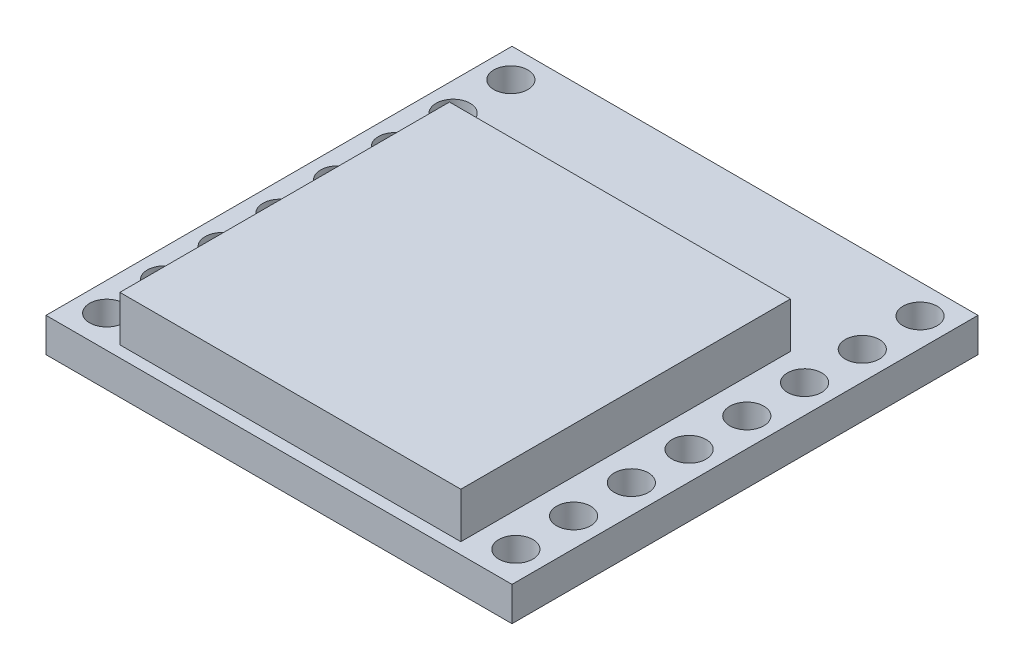
ISO-10303-21;
HEADER;
FILE_DESCRIPTION(('STEP AP214'),'2;1');
FILE_NAME('part.step','',(''),(''),'','','');
FILE_SCHEMA(('AUTOMOTIVE_DESIGN { 1 0 10303 214 1 1 1 1 }'));
ENDSEC;
DATA;
#1=APPLICATION_CONTEXT('core data for automotive mechanical design processes');
#2=APPLICATION_PROTOCOL_DEFINITION('international standard','automotive_design',2000,#1);
#3=PRODUCT_CONTEXT('',#1,'mechanical');
#4=PRODUCT('Part','Part','',(#3));
#5=PRODUCT_RELATED_PRODUCT_CATEGORY('part','',(#4));
#6=PRODUCT_DEFINITION_FORMATION('','',#4);
#7=PRODUCT_DEFINITION_CONTEXT('part definition',#1,'design');
#8=PRODUCT_DEFINITION('design','',#6,#7);
#9=PRODUCT_DEFINITION_SHAPE('','',#8);
#10=(LENGTH_UNIT() NAMED_UNIT(*) SI_UNIT(.MILLI.,.METRE.));
#11=(NAMED_UNIT(*) PLANE_ANGLE_UNIT() SI_UNIT($,.RADIAN.));
#12=(NAMED_UNIT(*) SI_UNIT($,.STERADIAN.) SOLID_ANGLE_UNIT());
#13=UNCERTAINTY_MEASURE_WITH_UNIT(LENGTH_MEASURE(1.E-05),#10,'distance_accuracy_value','');
#14=(GEOMETRIC_REPRESENTATION_CONTEXT(3) GLOBAL_UNCERTAINTY_ASSIGNED_CONTEXT((#13)) GLOBAL_UNIT_ASSIGNED_CONTEXT((#10,
#11,#12)) REPRESENTATION_CONTEXT('',''));
#15=CARTESIAN_POINT('',(0.,0.,0.));
#16=DIRECTION('',(0.,0.,1.));
#17=DIRECTION('',(1.,0.,0.));
#18=AXIS2_PLACEMENT_3D('',#15,#16,#17);
#19=CARTESIAN_POINT('',(0.,1.5,0.));
#20=DIRECTION('',(0.,-1.,0.));
#21=DIRECTION('',(0.,0.,-1.));
#22=AXIS2_PLACEMENT_3D('',#19,#20,#21);
#23=PLANE('',#22);
#24=DIRECTION('',(0.,0.,-1.));
#25=VECTOR('',#24,1.);
#26=CARTESIAN_POINT('',(10.25,1.5,10.25));
#27=LINE('',#26,#25);
#28=CARTESIAN_POINT('',(10.25,1.5,10.25));
#29=VERTEX_POINT('',#28);
#30=CARTESIAN_POINT('',(10.25,1.5,-10.25));
#31=VERTEX_POINT('',#30);
#32=EDGE_CURVE('E220',#29,#31,#27,.T.);
#33=ORIENTED_EDGE('',*,*,#32,.T.);
#34=DIRECTION('',(-1.,0.,0.));
#35=VECTOR('',#34,1.);
#36=CARTESIAN_POINT('',(-10.25,1.5,-10.25));
#37=LINE('',#36,#35);
#38=CARTESIAN_POINT('',(-10.25,1.5,-10.25));
#39=VERTEX_POINT('',#38);
#40=EDGE_CURVE('E223',#31,#39,#37,.T.);
#41=ORIENTED_EDGE('',*,*,#40,.T.);
#42=DIRECTION('',(0.,0.,1.));
#43=VECTOR('',#42,1.);
#44=CARTESIAN_POINT('',(-10.25,1.5,10.25));
#45=LINE('',#44,#43);
#46=CARTESIAN_POINT('',(-10.25,1.5,10.25));
#47=VERTEX_POINT('',#46);
#48=EDGE_CURVE('E226',#39,#47,#45,.T.);
#49=ORIENTED_EDGE('',*,*,#48,.T.);
#50=DIRECTION('',(1.,0.,0.));
#51=VECTOR('',#50,1.);
#52=CARTESIAN_POINT('',(-10.25,1.5,10.25));
#53=LINE('',#52,#51);
#54=EDGE_CURVE('E228',#47,#29,#53,.T.);
#55=ORIENTED_EDGE('',*,*,#54,.T.);
#56=EDGE_LOOP('',(#33,#41,#49,#55));
#57=FACE_BOUND('',#56,.T.);
#58=CARTESIAN_POINT('',(-9.,1.5,-8.95));
#59=DIRECTION('',(0.,-1.,0.));
#60=DIRECTION('',(0.,0.,-1.));
#61=AXIS2_PLACEMENT_3D('',#58,#59,#60);
#62=CIRCLE('',#61,0.75);
#63=CARTESIAN_POINT('',(-9.,1.5,-9.7));
#64=VERTEX_POINT('',#63);
#65=EDGE_CURVE('E130',#64,#64,#62,.T.);
#66=ORIENTED_EDGE('',*,*,#65,.T.);
#67=EDGE_LOOP('',(#66));
#68=FACE_BOUND('',#67,.T.);
#69=CARTESIAN_POINT('',(9.,1.5,-8.95));
#70=DIRECTION('',(0.,-1.,0.));
#71=DIRECTION('',(0.,0.,-1.));
#72=AXIS2_PLACEMENT_3D('',#69,#70,#71);
#73=CIRCLE('',#72,0.75);
#74=CARTESIAN_POINT('',(9.,1.5,-9.7));
#75=VERTEX_POINT('',#74);
#76=EDGE_CURVE('E118',#75,#75,#73,.T.);
#77=ORIENTED_EDGE('',*,*,#76,.T.);
#78=EDGE_LOOP('',(#77));
#79=FACE_BOUND('',#78,.T.);
#80=CARTESIAN_POINT('',(8.99999999999997,1.5,-6.41));
#81=DIRECTION('',(0.,-1.,0.));
#82=DIRECTION('',(0.,0.,-1.));
#83=AXIS2_PLACEMENT_3D('',#80,#81,#82);
#84=CIRCLE('',#83,0.75);
#85=CARTESIAN_POINT('',(8.99999999999997,1.5,-7.16));
#86=VERTEX_POINT('',#85);
#87=EDGE_CURVE('E209',#86,#86,#84,.T.);
#88=ORIENTED_EDGE('',*,*,#87,.T.);
#89=EDGE_LOOP('',(#88));
#90=FACE_BOUND('',#89,.T.);
#91=CARTESIAN_POINT('',(8.99999999999994,1.5,-3.87));
#92=DIRECTION('',(0.,-1.,0.));
#93=DIRECTION('',(0.,0.,-1.));
#94=AXIS2_PLACEMENT_3D('',#91,#92,#93);
#95=CIRCLE('',#94,0.75);
#96=CARTESIAN_POINT('',(8.99999999999994,1.5,-4.62));
#97=VERTEX_POINT('',#96);
#98=EDGE_CURVE('E203',#97,#97,#95,.T.);
#99=ORIENTED_EDGE('',*,*,#98,.T.);
#100=EDGE_LOOP('',(#99));
#101=FACE_BOUND('',#100,.T.);
#102=CARTESIAN_POINT('',(8.99999999999992,1.5,-1.33));
#103=DIRECTION('',(0.,-1.,0.));
#104=DIRECTION('',(0.,0.,-1.));
#105=AXIS2_PLACEMENT_3D('',#102,#103,#104);
#106=CIRCLE('',#105,0.75);
#107=CARTESIAN_POINT('',(8.99999999999992,1.5,-2.08));
#108=VERTEX_POINT('',#107);
#109=EDGE_CURVE('E197',#108,#108,#106,.T.);
#110=ORIENTED_EDGE('',*,*,#109,.T.);
#111=EDGE_LOOP('',(#110));
#112=FACE_BOUND('',#111,.T.);
#113=CARTESIAN_POINT('',(8.99999999999989,1.5,1.21));
#114=DIRECTION('',(0.,-1.,0.));
#115=DIRECTION('',(0.,0.,-1.));
#116=AXIS2_PLACEMENT_3D('',#113,#114,#115);
#117=CIRCLE('',#116,0.75);
#118=CARTESIAN_POINT('',(8.99999999999989,1.5,0.459999999999999));
#119=VERTEX_POINT('',#118);
#120=EDGE_CURVE('E191',#119,#119,#117,.T.);
#121=ORIENTED_EDGE('',*,*,#120,.T.);
#122=EDGE_LOOP('',(#121));
#123=FACE_BOUND('',#122,.T.);
#124=CARTESIAN_POINT('',(8.99999999999986,1.5,3.75));
#125=DIRECTION('',(0.,-1.,0.));
#126=DIRECTION('',(0.,0.,-1.));
#127=AXIS2_PLACEMENT_3D('',#124,#125,#126);
#128=CIRCLE('',#127,0.75);
#129=CARTESIAN_POINT('',(8.99999999999986,1.5,3.));
#130=VERTEX_POINT('',#129);
#131=EDGE_CURVE('E185',#130,#130,#128,.T.);
#132=ORIENTED_EDGE('',*,*,#131,.T.);
#133=EDGE_LOOP('',(#132));
#134=FACE_BOUND('',#133,.T.);
#135=CARTESIAN_POINT('',(8.99999999999984,1.5,6.29));
#136=DIRECTION('',(0.,-1.,0.));
#137=DIRECTION('',(0.,0.,-1.));
#138=AXIS2_PLACEMENT_3D('',#135,#136,#137);
#139=CIRCLE('',#138,0.75);
#140=CARTESIAN_POINT('',(8.99999999999984,1.5,5.54));
#141=VERTEX_POINT('',#140);
#142=EDGE_CURVE('E179',#141,#141,#139,.T.);
#143=ORIENTED_EDGE('',*,*,#142,.T.);
#144=EDGE_LOOP('',(#143));
#145=FACE_BOUND('',#144,.T.);
#146=CARTESIAN_POINT('',(8.99999999999981,1.5,8.83));
#147=DIRECTION('',(0.,-1.,0.));
#148=DIRECTION('',(0.,0.,-1.));
#149=AXIS2_PLACEMENT_3D('',#146,#147,#148);
#150=CIRCLE('',#149,0.75);
#151=CARTESIAN_POINT('',(8.99999999999981,1.5,8.08));
#152=VERTEX_POINT('',#151);
#153=EDGE_CURVE('E173',#152,#152,#150,.T.);
#154=ORIENTED_EDGE('',*,*,#153,.T.);
#155=EDGE_LOOP('',(#154));
#156=FACE_BOUND('',#155,.T.);
#157=CARTESIAN_POINT('',(-8.99999999999981,1.5,8.83));
#158=DIRECTION('',(0.,-1.,0.));
#159=DIRECTION('',(0.,0.,-1.));
#160=AXIS2_PLACEMENT_3D('',#157,#158,#159);
#161=CIRCLE('',#160,0.75);
#162=CARTESIAN_POINT('',(-8.99999999999981,1.5,8.08));
#163=VERTEX_POINT('',#162);
#164=EDGE_CURVE('E167',#163,#163,#161,.T.);
#165=ORIENTED_EDGE('',*,*,#164,.T.);
#166=EDGE_LOOP('',(#165));
#167=FACE_BOUND('',#166,.T.);
#168=CARTESIAN_POINT('',(-8.99999999999984,1.5,6.29));
#169=DIRECTION('',(0.,-1.,0.));
#170=DIRECTION('',(0.,0.,-1.));
#171=AXIS2_PLACEMENT_3D('',#168,#169,#170);
#172=CIRCLE('',#171,0.75);
#173=CARTESIAN_POINT('',(-8.99999999999984,1.5,5.54));
#174=VERTEX_POINT('',#173);
#175=EDGE_CURVE('E161',#174,#174,#172,.T.);
#176=ORIENTED_EDGE('',*,*,#175,.T.);
#177=EDGE_LOOP('',(#176));
#178=FACE_BOUND('',#177,.T.);
#179=CARTESIAN_POINT('',(-8.99999999999986,1.5,3.75));
#180=DIRECTION('',(0.,-1.,0.));
#181=DIRECTION('',(0.,0.,-1.));
#182=AXIS2_PLACEMENT_3D('',#179,#180,#181);
#183=CIRCLE('',#182,0.75);
#184=CARTESIAN_POINT('',(-8.99999999999986,1.5,3.));
#185=VERTEX_POINT('',#184);
#186=EDGE_CURVE('E155',#185,#185,#183,.T.);
#187=ORIENTED_EDGE('',*,*,#186,.T.);
#188=EDGE_LOOP('',(#187));
#189=FACE_BOUND('',#188,.T.);
#190=CARTESIAN_POINT('',(-8.99999999999989,1.5,1.21));
#191=DIRECTION('',(0.,-1.,0.));
#192=DIRECTION('',(0.,0.,-1.));
#193=AXIS2_PLACEMENT_3D('',#190,#191,#192);
#194=CIRCLE('',#193,0.75);
#195=CARTESIAN_POINT('',(-8.99999999999989,1.5,0.459999999999999));
#196=VERTEX_POINT('',#195);
#197=EDGE_CURVE('E149',#196,#196,#194,.T.);
#198=ORIENTED_EDGE('',*,*,#197,.T.);
#199=EDGE_LOOP('',(#198));
#200=FACE_BOUND('',#199,.T.);
#201=CARTESIAN_POINT('',(-8.99999999999992,1.5,-1.33));
#202=DIRECTION('',(0.,-1.,0.));
#203=DIRECTION('',(0.,0.,-1.));
#204=AXIS2_PLACEMENT_3D('',#201,#202,#203);
#205=CIRCLE('',#204,0.75);
#206=CARTESIAN_POINT('',(-8.99999999999992,1.5,-2.08));
#207=VERTEX_POINT('',#206);
#208=EDGE_CURVE('E143',#207,#207,#205,.T.);
#209=ORIENTED_EDGE('',*,*,#208,.T.);
#210=EDGE_LOOP('',(#209));
#211=FACE_BOUND('',#210,.T.);
#212=CARTESIAN_POINT('',(-8.99999999999994,1.5,-3.87));
#213=DIRECTION('',(0.,-1.,0.));
#214=DIRECTION('',(0.,0.,-1.));
#215=AXIS2_PLACEMENT_3D('',#212,#213,#214);
#216=CIRCLE('',#215,0.75);
#217=CARTESIAN_POINT('',(-8.99999999999994,1.5,-4.62));
#218=VERTEX_POINT('',#217);
#219=EDGE_CURVE('E137',#218,#218,#216,.T.);
#220=ORIENTED_EDGE('',*,*,#219,.T.);
#221=EDGE_LOOP('',(#220));
#222=FACE_BOUND('',#221,.T.);
#223=CARTESIAN_POINT('',(-8.99999999999997,1.5,-6.41));
#224=DIRECTION('',(0.,-1.,0.));
#225=DIRECTION('',(0.,0.,-1.));
#226=AXIS2_PLACEMENT_3D('',#223,#224,#225);
#227=CIRCLE('',#226,0.75);
#228=CARTESIAN_POINT('',(-8.99999999999997,1.5,-7.16));
#229=VERTEX_POINT('',#228);
#230=EDGE_CURVE('E131',#229,#229,#227,.T.);
#231=ORIENTED_EDGE('',*,*,#230,.T.);
#232=EDGE_LOOP('',(#231));
#233=FACE_BOUND('',#232,.T.);
#234=DIRECTION('',(1.,0.,0.));
#235=VECTOR('',#234,1.);
#236=CARTESIAN_POINT('',(0.,1.5,9.75));
#237=LINE('',#236,#235);
#238=CARTESIAN_POINT('',(-7.5,1.5,9.75));
#239=VERTEX_POINT('',#238);
#240=CARTESIAN_POINT('',(7.5,1.5,9.75));
#241=VERTEX_POINT('',#240);
#242=EDGE_CURVE('E117',#239,#241,#237,.T.);
#243=ORIENTED_EDGE('',*,*,#242,.F.);
#244=DIRECTION('',(0.,0.,1.));
#245=VECTOR('',#244,1.);
#246=CARTESIAN_POINT('',(-7.5,1.5,0.));
#247=LINE('',#246,#245);
#248=CARTESIAN_POINT('',(-7.5,1.5,-4.75));
#249=VERTEX_POINT('',#248);
#250=EDGE_CURVE('E114',#249,#239,#247,.T.);
#251=ORIENTED_EDGE('',*,*,#250,.F.);
#252=DIRECTION('',(-1.,0.,0.));
#253=VECTOR('',#252,1.);
#254=CARTESIAN_POINT('',(0.,1.5,-4.75));
#255=LINE('',#254,#253);
#256=CARTESIAN_POINT('',(7.5,1.5,-4.75));
#257=VERTEX_POINT('',#256);
#258=EDGE_CURVE('E52',#257,#249,#255,.T.);
#259=ORIENTED_EDGE('',*,*,#258,.F.);
#260=DIRECTION('',(0.,0.,-1.));
#261=VECTOR('',#260,1.);
#262=CARTESIAN_POINT('',(7.5,1.5,0.));
#263=LINE('',#262,#261);
#264=EDGE_CURVE('E47',#241,#257,#263,.T.);
#265=ORIENTED_EDGE('',*,*,#264,.F.);
#266=EDGE_LOOP('',(#243,#251,#259,#265));
#267=FACE_BOUND('',#266,.T.);
#268=ADVANCED_FACE('F32',(#57,#68,#79,#90,#101,#112,#123,#134,#145,#156,#167,#178,#189,#200,
#211,#222,#233,#267),#23,.F.);
#269=CARTESIAN_POINT('',(10.25,1.5,10.25));
#270=DIRECTION('',(-1.,0.,0.));
#271=DIRECTION('',(0.,0.,1.));
#272=AXIS2_PLACEMENT_3D('',#269,#270,#271);
#273=PLANE('',#272);
#274=DIRECTION('',(0.,0.,-1.));
#275=VECTOR('',#274,1.);
#276=CARTESIAN_POINT('',(10.25,0.,10.25));
#277=LINE('',#276,#275);
#278=CARTESIAN_POINT('',(10.25,0.,10.25));
#279=VERTEX_POINT('',#278);
#280=CARTESIAN_POINT('',(10.25,0.,-10.25));
#281=VERTEX_POINT('',#280);
#282=EDGE_CURVE('E217',#279,#281,#277,.T.);
#283=ORIENTED_EDGE('',*,*,#282,.T.);
#284=DIRECTION('',(0.,-1.,0.));
#285=VECTOR('',#284,1.);
#286=CARTESIAN_POINT('',(10.25,1.5,-10.25));
#287=LINE('',#286,#285);
#288=EDGE_CURVE('E11',#31,#281,#287,.T.);
#289=ORIENTED_EDGE('',*,*,#288,.F.);
#290=ORIENTED_EDGE('',*,*,#32,.F.);
#291=DIRECTION('',(0.,-1.,0.));
#292=VECTOR('',#291,1.);
#293=CARTESIAN_POINT('',(10.25,1.5,10.25));
#294=LINE('',#293,#292);
#295=EDGE_CURVE('E230',#29,#279,#294,.T.);
#296=ORIENTED_EDGE('',*,*,#295,.T.);
#297=EDGE_LOOP('',(#283,#289,#290,#296));
#298=FACE_BOUND('',#297,.T.);
#299=ADVANCED_FACE('F34',(#298),#273,.F.);
#300=CARTESIAN_POINT('',(-10.25,1.5,-10.25));
#301=DIRECTION('',(0.,0.,1.));
#302=DIRECTION('',(1.,0.,0.));
#303=AXIS2_PLACEMENT_3D('',#300,#301,#302);
#304=PLANE('',#303);
#305=DIRECTION('',(-1.,0.,0.));
#306=VECTOR('',#305,1.);
#307=CARTESIAN_POINT('',(-10.25,0.,-10.25));
#308=LINE('',#307,#306);
#309=CARTESIAN_POINT('',(-10.25,0.,-10.25));
#310=VERTEX_POINT('',#309);
#311=EDGE_CURVE('E233',#281,#310,#308,.T.);
#312=ORIENTED_EDGE('',*,*,#311,.T.);
#313=DIRECTION('',(0.,-1.,0.));
#314=VECTOR('',#313,1.);
#315=CARTESIAN_POINT('',(-10.25,1.5,-10.25));
#316=LINE('',#315,#314);
#317=EDGE_CURVE('E40',#39,#310,#316,.T.);
#318=ORIENTED_EDGE('',*,*,#317,.F.);
#319=ORIENTED_EDGE('',*,*,#40,.F.);
#320=ORIENTED_EDGE('',*,*,#288,.T.);
#321=EDGE_LOOP('',(#312,#318,#319,#320));
#322=FACE_BOUND('',#321,.T.);
#323=ADVANCED_FACE('F263',(#322),#304,.F.);
#324=CARTESIAN_POINT('',(-10.25,1.5,10.25));
#325=DIRECTION('',(1.,0.,0.));
#326=DIRECTION('',(0.,0.,-1.));
#327=AXIS2_PLACEMENT_3D('',#324,#325,#326);
#328=PLANE('',#327);
#329=DIRECTION('',(0.,0.,1.));
#330=VECTOR('',#329,1.);
#331=CARTESIAN_POINT('',(-10.25,0.,10.25));
#332=LINE('',#331,#330);
#333=CARTESIAN_POINT('',(-10.25,0.,10.25));
#334=VERTEX_POINT('',#333);
#335=EDGE_CURVE('E235',#310,#334,#332,.T.);
#336=ORIENTED_EDGE('',*,*,#335,.T.);
#337=DIRECTION('',(0.,-1.,0.));
#338=VECTOR('',#337,1.);
#339=CARTESIAN_POINT('',(-10.25,1.5,10.25));
#340=LINE('',#339,#338);
#341=EDGE_CURVE('E240',#47,#334,#340,.T.);
#342=ORIENTED_EDGE('',*,*,#341,.F.);
#343=ORIENTED_EDGE('',*,*,#48,.F.);
#344=ORIENTED_EDGE('',*,*,#317,.T.);
#345=EDGE_LOOP('',(#336,#342,#343,#344));
#346=FACE_BOUND('',#345,.T.);
#347=ADVANCED_FACE('F247',(#346),#328,.F.);
#348=CARTESIAN_POINT('',(-10.25,1.5,10.25));
#349=DIRECTION('',(0.,0.,-1.));
#350=DIRECTION('',(-1.,0.,0.));
#351=AXIS2_PLACEMENT_3D('',#348,#349,#350);
#352=PLANE('',#351);
#353=DIRECTION('',(1.,0.,0.));
#354=VECTOR('',#353,1.);
#355=CARTESIAN_POINT('',(-10.25,0.,10.25));
#356=LINE('',#355,#354);
#357=EDGE_CURVE('E224',#334,#279,#356,.T.);
#358=ORIENTED_EDGE('',*,*,#357,.T.);
#359=ORIENTED_EDGE('',*,*,#295,.F.);
#360=ORIENTED_EDGE('',*,*,#54,.F.);
#361=ORIENTED_EDGE('',*,*,#341,.T.);
#362=EDGE_LOOP('',(#358,#359,#360,#361));
#363=FACE_BOUND('',#362,.T.);
#364=ADVANCED_FACE('F256',(#363),#352,.F.);
#365=CARTESIAN_POINT('',(0.,0.,0.));
#366=DIRECTION('',(0.,-1.,0.));
#367=DIRECTION('',(0.,0.,-1.));
#368=AXIS2_PLACEMENT_3D('',#365,#366,#367);
#369=PLANE('',#368);
#370=CARTESIAN_POINT('',(-8.99999999999997,0.,-6.41));
#371=DIRECTION('',(0.,-1.,0.));
#372=DIRECTION('',(0.,0.,-1.));
#373=AXIS2_PLACEMENT_3D('',#370,#371,#372);
#374=CIRCLE('',#373,0.75);
#375=CARTESIAN_POINT('',(-8.99999999999997,0.,-7.16));
#376=VERTEX_POINT('',#375);
#377=EDGE_CURVE('E127',#376,#376,#374,.T.);
#378=ORIENTED_EDGE('',*,*,#377,.F.);
#379=EDGE_LOOP('',(#378));
#380=FACE_BOUND('',#379,.T.);
#381=CARTESIAN_POINT('',(-8.99999999999994,0.,-3.87));
#382=DIRECTION('',(0.,-1.,0.));
#383=DIRECTION('',(0.,0.,-1.));
#384=AXIS2_PLACEMENT_3D('',#381,#382,#383);
#385=CIRCLE('',#384,0.75);
#386=CARTESIAN_POINT('',(-8.99999999999994,0.,-4.62));
#387=VERTEX_POINT('',#386);
#388=EDGE_CURVE('E134',#387,#387,#385,.T.);
#389=ORIENTED_EDGE('',*,*,#388,.F.);
#390=EDGE_LOOP('',(#389));
#391=FACE_BOUND('',#390,.T.);
#392=CARTESIAN_POINT('',(-8.99999999999992,0.,-1.33));
#393=DIRECTION('',(0.,-1.,0.));
#394=DIRECTION('',(0.,0.,-1.));
#395=AXIS2_PLACEMENT_3D('',#392,#393,#394);
#396=CIRCLE('',#395,0.75);
#397=CARTESIAN_POINT('',(-8.99999999999992,0.,-2.08));
#398=VERTEX_POINT('',#397);
#399=EDGE_CURVE('E140',#398,#398,#396,.T.);
#400=ORIENTED_EDGE('',*,*,#399,.F.);
#401=EDGE_LOOP('',(#400));
#402=FACE_BOUND('',#401,.T.);
#403=CARTESIAN_POINT('',(-8.99999999999989,0.,1.21));
#404=DIRECTION('',(0.,-1.,0.));
#405=DIRECTION('',(0.,0.,-1.));
#406=AXIS2_PLACEMENT_3D('',#403,#404,#405);
#407=CIRCLE('',#406,0.75);
#408=CARTESIAN_POINT('',(-8.99999999999989,0.,0.459999999999999));
#409=VERTEX_POINT('',#408);
#410=EDGE_CURVE('E146',#409,#409,#407,.T.);
#411=ORIENTED_EDGE('',*,*,#410,.F.);
#412=EDGE_LOOP('',(#411));
#413=FACE_BOUND('',#412,.T.);
#414=CARTESIAN_POINT('',(-8.99999999999986,0.,3.75));
#415=DIRECTION('',(0.,-1.,0.));
#416=DIRECTION('',(0.,0.,-1.));
#417=AXIS2_PLACEMENT_3D('',#414,#415,#416);
#418=CIRCLE('',#417,0.75);
#419=CARTESIAN_POINT('',(-8.99999999999986,0.,3.));
#420=VERTEX_POINT('',#419);
#421=EDGE_CURVE('E152',#420,#420,#418,.T.);
#422=ORIENTED_EDGE('',*,*,#421,.F.);
#423=EDGE_LOOP('',(#422));
#424=FACE_BOUND('',#423,.T.);
#425=CARTESIAN_POINT('',(-8.99999999999984,0.,6.29));
#426=DIRECTION('',(0.,-1.,0.));
#427=DIRECTION('',(0.,0.,-1.));
#428=AXIS2_PLACEMENT_3D('',#425,#426,#427);
#429=CIRCLE('',#428,0.75);
#430=CARTESIAN_POINT('',(-8.99999999999984,0.,5.54));
#431=VERTEX_POINT('',#430);
#432=EDGE_CURVE('E158',#431,#431,#429,.T.);
#433=ORIENTED_EDGE('',*,*,#432,.F.);
#434=EDGE_LOOP('',(#433));
#435=FACE_BOUND('',#434,.T.);
#436=CARTESIAN_POINT('',(-8.99999999999981,0.,8.83));
#437=DIRECTION('',(0.,-1.,0.));
#438=DIRECTION('',(0.,0.,-1.));
#439=AXIS2_PLACEMENT_3D('',#436,#437,#438);
#440=CIRCLE('',#439,0.75);
#441=CARTESIAN_POINT('',(-8.99999999999981,0.,8.08));
#442=VERTEX_POINT('',#441);
#443=EDGE_CURVE('E164',#442,#442,#440,.T.);
#444=ORIENTED_EDGE('',*,*,#443,.F.);
#445=EDGE_LOOP('',(#444));
#446=FACE_BOUND('',#445,.T.);
#447=CARTESIAN_POINT('',(8.99999999999981,0.,8.83));
#448=DIRECTION('',(0.,-1.,0.));
#449=DIRECTION('',(0.,0.,-1.));
#450=AXIS2_PLACEMENT_3D('',#447,#448,#449);
#451=CIRCLE('',#450,0.75);
#452=CARTESIAN_POINT('',(8.99999999999981,0.,8.08));
#453=VERTEX_POINT('',#452);
#454=EDGE_CURVE('E170',#453,#453,#451,.T.);
#455=ORIENTED_EDGE('',*,*,#454,.F.);
#456=EDGE_LOOP('',(#455));
#457=FACE_BOUND('',#456,.T.);
#458=CARTESIAN_POINT('',(8.99999999999984,0.,6.29));
#459=DIRECTION('',(0.,-1.,0.));
#460=DIRECTION('',(0.,0.,-1.));
#461=AXIS2_PLACEMENT_3D('',#458,#459,#460);
#462=CIRCLE('',#461,0.75);
#463=CARTESIAN_POINT('',(8.99999999999984,0.,5.54));
#464=VERTEX_POINT('',#463);
#465=EDGE_CURVE('E176',#464,#464,#462,.T.);
#466=ORIENTED_EDGE('',*,*,#465,.F.);
#467=EDGE_LOOP('',(#466));
#468=FACE_BOUND('',#467,.T.);
#469=CARTESIAN_POINT('',(8.99999999999986,0.,3.75));
#470=DIRECTION('',(0.,-1.,0.));
#471=DIRECTION('',(0.,0.,-1.));
#472=AXIS2_PLACEMENT_3D('',#469,#470,#471);
#473=CIRCLE('',#472,0.75);
#474=CARTESIAN_POINT('',(8.99999999999986,0.,3.));
#475=VERTEX_POINT('',#474);
#476=EDGE_CURVE('E182',#475,#475,#473,.T.);
#477=ORIENTED_EDGE('',*,*,#476,.F.);
#478=EDGE_LOOP('',(#477));
#479=FACE_BOUND('',#478,.T.);
#480=CARTESIAN_POINT('',(8.99999999999989,0.,1.21));
#481=DIRECTION('',(0.,-1.,0.));
#482=DIRECTION('',(0.,0.,-1.));
#483=AXIS2_PLACEMENT_3D('',#480,#481,#482);
#484=CIRCLE('',#483,0.75);
#485=CARTESIAN_POINT('',(8.99999999999989,0.,0.459999999999999));
#486=VERTEX_POINT('',#485);
#487=EDGE_CURVE('E188',#486,#486,#484,.T.);
#488=ORIENTED_EDGE('',*,*,#487,.F.);
#489=EDGE_LOOP('',(#488));
#490=FACE_BOUND('',#489,.T.);
#491=CARTESIAN_POINT('',(8.99999999999992,0.,-1.33));
#492=DIRECTION('',(0.,-1.,0.));
#493=DIRECTION('',(0.,0.,-1.));
#494=AXIS2_PLACEMENT_3D('',#491,#492,#493);
#495=CIRCLE('',#494,0.75);
#496=CARTESIAN_POINT('',(8.99999999999992,0.,-2.08));
#497=VERTEX_POINT('',#496);
#498=EDGE_CURVE('E194',#497,#497,#495,.T.);
#499=ORIENTED_EDGE('',*,*,#498,.F.);
#500=EDGE_LOOP('',(#499));
#501=FACE_BOUND('',#500,.T.);
#502=CARTESIAN_POINT('',(8.99999999999994,0.,-3.87));
#503=DIRECTION('',(0.,-1.,0.));
#504=DIRECTION('',(0.,0.,-1.));
#505=AXIS2_PLACEMENT_3D('',#502,#503,#504);
#506=CIRCLE('',#505,0.75);
#507=CARTESIAN_POINT('',(8.99999999999994,0.,-4.62));
#508=VERTEX_POINT('',#507);
#509=EDGE_CURVE('E200',#508,#508,#506,.T.);
#510=ORIENTED_EDGE('',*,*,#509,.F.);
#511=EDGE_LOOP('',(#510));
#512=FACE_BOUND('',#511,.T.);
#513=CARTESIAN_POINT('',(8.99999999999997,0.,-6.41));
#514=DIRECTION('',(0.,-1.,0.));
#515=DIRECTION('',(0.,0.,-1.));
#516=AXIS2_PLACEMENT_3D('',#513,#514,#515);
#517=CIRCLE('',#516,0.75);
#518=CARTESIAN_POINT('',(8.99999999999997,0.,-7.16));
#519=VERTEX_POINT('',#518);
#520=EDGE_CURVE('E206',#519,#519,#517,.T.);
#521=ORIENTED_EDGE('',*,*,#520,.F.);
#522=EDGE_LOOP('',(#521));
#523=FACE_BOUND('',#522,.T.);
#524=CARTESIAN_POINT('',(9.,0.,-8.95));
#525=DIRECTION('',(0.,-1.,0.));
#526=DIRECTION('',(0.,0.,-1.));
#527=AXIS2_PLACEMENT_3D('',#524,#525,#526);
#528=CIRCLE('',#527,0.75);
#529=CARTESIAN_POINT('',(9.,0.,-9.7));
#530=VERTEX_POINT('',#529);
#531=EDGE_CURVE('E121',#530,#530,#528,.T.);
#532=ORIENTED_EDGE('',*,*,#531,.F.);
#533=EDGE_LOOP('',(#532));
#534=FACE_BOUND('',#533,.T.);
#535=CARTESIAN_POINT('',(-9.,0.,-8.95));
#536=DIRECTION('',(0.,-1.,0.));
#537=DIRECTION('',(0.,0.,-1.));
#538=AXIS2_PLACEMENT_3D('',#535,#536,#537);
#539=CIRCLE('',#538,0.75);
#540=CARTESIAN_POINT('',(-9.,0.,-9.7));
#541=VERTEX_POINT('',#540);
#542=EDGE_CURVE('E214',#541,#541,#539,.T.);
#543=ORIENTED_EDGE('',*,*,#542,.F.);
#544=EDGE_LOOP('',(#543));
#545=FACE_BOUND('',#544,.T.);
#546=ORIENTED_EDGE('',*,*,#282,.F.);
#547=ORIENTED_EDGE('',*,*,#357,.F.);
#548=ORIENTED_EDGE('',*,*,#335,.F.);
#549=ORIENTED_EDGE('',*,*,#311,.F.);
#550=EDGE_LOOP('',(#546,#547,#548,#549));
#551=FACE_BOUND('',#550,.T.);
#552=ADVANCED_FACE('F253',(#380,#391,#402,#413,#424,#435,#446,#457,#468,#479,#490,#501,#512,
#523,#534,#545,#551),#369,.T.);
#553=CARTESIAN_POINT('',(-9.,0.,-8.95));
#554=DIRECTION('',(0.,1.,0.));
#555=DIRECTION('',(0.,0.,1.));
#556=AXIS2_PLACEMENT_3D('',#553,#554,#555);
#557=CYLINDRICAL_SURFACE('',#556,0.75);
#558=ORIENTED_EDGE('',*,*,#542,.T.);
#559=EDGE_LOOP('',(#558));
#560=FACE_BOUND('',#559,.T.);
#561=ORIENTED_EDGE('',*,*,#65,.F.);
#562=EDGE_LOOP('',(#561));
#563=FACE_BOUND('',#562,.T.);
#564=ADVANCED_FACE('F276',(#560,#563),#557,.F.);
#565=CARTESIAN_POINT('',(9.,0.,-8.95));
#566=DIRECTION('',(0.,1.,0.));
#567=DIRECTION('',(0.,0.,1.));
#568=AXIS2_PLACEMENT_3D('',#565,#566,#567);
#569=CYLINDRICAL_SURFACE('',#568,0.75);
#570=ORIENTED_EDGE('',*,*,#531,.T.);
#571=EDGE_LOOP('',(#570));
#572=FACE_BOUND('',#571,.T.);
#573=ORIENTED_EDGE('',*,*,#76,.F.);
#574=EDGE_LOOP('',(#573));
#575=FACE_BOUND('',#574,.T.);
#576=ADVANCED_FACE('F296',(#572,#575),#569,.F.);
#577=CARTESIAN_POINT('',(8.99999999999997,0.,-6.41));
#578=DIRECTION('',(0.,1.,0.));
#579=DIRECTION('',(0.,0.,1.));
#580=AXIS2_PLACEMENT_3D('',#577,#578,#579);
#581=CYLINDRICAL_SURFACE('',#580,0.75);
#582=ORIENTED_EDGE('',*,*,#520,.T.);
#583=EDGE_LOOP('',(#582));
#584=FACE_BOUND('',#583,.T.);
#585=ORIENTED_EDGE('',*,*,#87,.F.);
#586=EDGE_LOOP('',(#585));
#587=FACE_BOUND('',#586,.T.);
#588=ADVANCED_FACE('F303',(#584,#587),#581,.F.);
#589=CARTESIAN_POINT('',(8.99999999999994,0.,-3.87));
#590=DIRECTION('',(0.,1.,0.));
#591=DIRECTION('',(0.,0.,1.));
#592=AXIS2_PLACEMENT_3D('',#589,#590,#591);
#593=CYLINDRICAL_SURFACE('',#592,0.75);
#594=ORIENTED_EDGE('',*,*,#509,.T.);
#595=EDGE_LOOP('',(#594));
#596=FACE_BOUND('',#595,.T.);
#597=ORIENTED_EDGE('',*,*,#98,.F.);
#598=EDGE_LOOP('',(#597));
#599=FACE_BOUND('',#598,.T.);
#600=ADVANCED_FACE('F310',(#596,#599),#593,.F.);
#601=CARTESIAN_POINT('',(8.99999999999992,0.,-1.33));
#602=DIRECTION('',(0.,1.,0.));
#603=DIRECTION('',(0.,0.,1.));
#604=AXIS2_PLACEMENT_3D('',#601,#602,#603);
#605=CYLINDRICAL_SURFACE('',#604,0.75);
#606=ORIENTED_EDGE('',*,*,#498,.T.);
#607=EDGE_LOOP('',(#606));
#608=FACE_BOUND('',#607,.T.);
#609=ORIENTED_EDGE('',*,*,#109,.F.);
#610=EDGE_LOOP('',(#609));
#611=FACE_BOUND('',#610,.T.);
#612=ADVANCED_FACE('F318',(#608,#611),#605,.F.);
#613=CARTESIAN_POINT('',(8.99999999999989,0.,1.21));
#614=DIRECTION('',(0.,1.,0.));
#615=DIRECTION('',(0.,0.,1.));
#616=AXIS2_PLACEMENT_3D('',#613,#614,#615);
#617=CYLINDRICAL_SURFACE('',#616,0.75);
#618=ORIENTED_EDGE('',*,*,#487,.T.);
#619=EDGE_LOOP('',(#618));
#620=FACE_BOUND('',#619,.T.);
#621=ORIENTED_EDGE('',*,*,#120,.F.);
#622=EDGE_LOOP('',(#621));
#623=FACE_BOUND('',#622,.T.);
#624=ADVANCED_FACE('F326',(#620,#623),#617,.F.);
#625=CARTESIAN_POINT('',(8.99999999999986,0.,3.75));
#626=DIRECTION('',(0.,1.,0.));
#627=DIRECTION('',(0.,0.,1.));
#628=AXIS2_PLACEMENT_3D('',#625,#626,#627);
#629=CYLINDRICAL_SURFACE('',#628,0.75);
#630=ORIENTED_EDGE('',*,*,#476,.T.);
#631=EDGE_LOOP('',(#630));
#632=FACE_BOUND('',#631,.T.);
#633=ORIENTED_EDGE('',*,*,#131,.F.);
#634=EDGE_LOOP('',(#633));
#635=FACE_BOUND('',#634,.T.);
#636=ADVANCED_FACE('F334',(#632,#635),#629,.F.);
#637=CARTESIAN_POINT('',(8.99999999999984,0.,6.29));
#638=DIRECTION('',(0.,1.,0.));
#639=DIRECTION('',(0.,0.,1.));
#640=AXIS2_PLACEMENT_3D('',#637,#638,#639);
#641=CYLINDRICAL_SURFACE('',#640,0.75);
#642=ORIENTED_EDGE('',*,*,#465,.T.);
#643=EDGE_LOOP('',(#642));
#644=FACE_BOUND('',#643,.T.);
#645=ORIENTED_EDGE('',*,*,#142,.F.);
#646=EDGE_LOOP('',(#645));
#647=FACE_BOUND('',#646,.T.);
#648=ADVANCED_FACE('F342',(#644,#647),#641,.F.);
#649=CARTESIAN_POINT('',(8.99999999999981,0.,8.83));
#650=DIRECTION('',(0.,1.,0.));
#651=DIRECTION('',(0.,0.,1.));
#652=AXIS2_PLACEMENT_3D('',#649,#650,#651);
#653=CYLINDRICAL_SURFACE('',#652,0.75);
#654=ORIENTED_EDGE('',*,*,#454,.T.);
#655=EDGE_LOOP('',(#654));
#656=FACE_BOUND('',#655,.T.);
#657=ORIENTED_EDGE('',*,*,#153,.F.);
#658=EDGE_LOOP('',(#657));
#659=FACE_BOUND('',#658,.T.);
#660=ADVANCED_FACE('F350',(#656,#659),#653,.F.);
#661=CARTESIAN_POINT('',(-8.99999999999981,0.,8.83));
#662=DIRECTION('',(0.,1.,0.));
#663=DIRECTION('',(0.,0.,1.));
#664=AXIS2_PLACEMENT_3D('',#661,#662,#663);
#665=CYLINDRICAL_SURFACE('',#664,0.75);
#666=ORIENTED_EDGE('',*,*,#443,.T.);
#667=EDGE_LOOP('',(#666));
#668=FACE_BOUND('',#667,.T.);
#669=ORIENTED_EDGE('',*,*,#164,.F.);
#670=EDGE_LOOP('',(#669));
#671=FACE_BOUND('',#670,.T.);
#672=ADVANCED_FACE('F358',(#668,#671),#665,.F.);
#673=CARTESIAN_POINT('',(-8.99999999999984,0.,6.29));
#674=DIRECTION('',(0.,1.,0.));
#675=DIRECTION('',(0.,0.,1.));
#676=AXIS2_PLACEMENT_3D('',#673,#674,#675);
#677=CYLINDRICAL_SURFACE('',#676,0.75);
#678=ORIENTED_EDGE('',*,*,#432,.T.);
#679=EDGE_LOOP('',(#678));
#680=FACE_BOUND('',#679,.T.);
#681=ORIENTED_EDGE('',*,*,#175,.F.);
#682=EDGE_LOOP('',(#681));
#683=FACE_BOUND('',#682,.T.);
#684=ADVANCED_FACE('F366',(#680,#683),#677,.F.);
#685=CARTESIAN_POINT('',(-8.99999999999986,0.,3.75));
#686=DIRECTION('',(0.,1.,0.));
#687=DIRECTION('',(0.,0.,1.));
#688=AXIS2_PLACEMENT_3D('',#685,#686,#687);
#689=CYLINDRICAL_SURFACE('',#688,0.75);
#690=ORIENTED_EDGE('',*,*,#421,.T.);
#691=EDGE_LOOP('',(#690));
#692=FACE_BOUND('',#691,.T.);
#693=ORIENTED_EDGE('',*,*,#186,.F.);
#694=EDGE_LOOP('',(#693));
#695=FACE_BOUND('',#694,.T.);
#696=ADVANCED_FACE('F374',(#692,#695),#689,.F.);
#697=CARTESIAN_POINT('',(-8.99999999999989,0.,1.21));
#698=DIRECTION('',(0.,1.,0.));
#699=DIRECTION('',(0.,0.,1.));
#700=AXIS2_PLACEMENT_3D('',#697,#698,#699);
#701=CYLINDRICAL_SURFACE('',#700,0.75);
#702=ORIENTED_EDGE('',*,*,#410,.T.);
#703=EDGE_LOOP('',(#702));
#704=FACE_BOUND('',#703,.T.);
#705=ORIENTED_EDGE('',*,*,#197,.F.);
#706=EDGE_LOOP('',(#705));
#707=FACE_BOUND('',#706,.T.);
#708=ADVANCED_FACE('F382',(#704,#707),#701,.F.);
#709=CARTESIAN_POINT('',(-8.99999999999992,0.,-1.33));
#710=DIRECTION('',(0.,1.,0.));
#711=DIRECTION('',(0.,0.,1.));
#712=AXIS2_PLACEMENT_3D('',#709,#710,#711);
#713=CYLINDRICAL_SURFACE('',#712,0.75);
#714=ORIENTED_EDGE('',*,*,#399,.T.);
#715=EDGE_LOOP('',(#714));
#716=FACE_BOUND('',#715,.T.);
#717=ORIENTED_EDGE('',*,*,#208,.F.);
#718=EDGE_LOOP('',(#717));
#719=FACE_BOUND('',#718,.T.);
#720=ADVANCED_FACE('F390',(#716,#719),#713,.F.);
#721=CARTESIAN_POINT('',(-8.99999999999994,0.,-3.87));
#722=DIRECTION('',(0.,1.,0.));
#723=DIRECTION('',(0.,0.,1.));
#724=AXIS2_PLACEMENT_3D('',#721,#722,#723);
#725=CYLINDRICAL_SURFACE('',#724,0.75);
#726=ORIENTED_EDGE('',*,*,#388,.T.);
#727=EDGE_LOOP('',(#726));
#728=FACE_BOUND('',#727,.T.);
#729=ORIENTED_EDGE('',*,*,#219,.F.);
#730=EDGE_LOOP('',(#729));
#731=FACE_BOUND('',#730,.T.);
#732=ADVANCED_FACE('F398',(#728,#731),#725,.F.);
#733=CARTESIAN_POINT('',(-8.99999999999997,0.,-6.41));
#734=DIRECTION('',(0.,1.,0.));
#735=DIRECTION('',(0.,0.,1.));
#736=AXIS2_PLACEMENT_3D('',#733,#734,#735);
#737=CYLINDRICAL_SURFACE('',#736,0.75);
#738=ORIENTED_EDGE('',*,*,#377,.T.);
#739=EDGE_LOOP('',(#738));
#740=FACE_BOUND('',#739,.T.);
#741=ORIENTED_EDGE('',*,*,#230,.F.);
#742=EDGE_LOOP('',(#741));
#743=FACE_BOUND('',#742,.T.);
#744=ADVANCED_FACE('F406',(#740,#743),#737,.F.);
#745=CARTESIAN_POINT('',(0.,3.5,9.75));
#746=DIRECTION('',(0.,0.,-1.));
#747=DIRECTION('',(-1.,0.,0.));
#748=AXIS2_PLACEMENT_3D('',#745,#746,#747);
#749=PLANE('',#748);
#750=ORIENTED_EDGE('',*,*,#242,.T.);
#751=DIRECTION('',(0.,-1.,0.));
#752=VECTOR('',#751,1.);
#753=CARTESIAN_POINT('',(7.5,3.5,9.75));
#754=LINE('',#753,#752);
#755=CARTESIAN_POINT('',(7.5,3.5,9.75));
#756=VERTEX_POINT('',#755);
#757=EDGE_CURVE('E98',#756,#241,#754,.T.);
#758=ORIENTED_EDGE('',*,*,#757,.F.);
#759=DIRECTION('',(1.,0.,0.));
#760=VECTOR('',#759,1.);
#761=CARTESIAN_POINT('',(0.,3.5,9.75));
#762=LINE('',#761,#760);
#763=CARTESIAN_POINT('',(-7.5,3.5,9.75));
#764=VERTEX_POINT('',#763);
#765=EDGE_CURVE('E105',#764,#756,#762,.T.);
#766=ORIENTED_EDGE('',*,*,#765,.F.);
#767=DIRECTION('',(0.,-1.,0.));
#768=VECTOR('',#767,1.);
#769=CARTESIAN_POINT('',(-7.5,3.5,9.75));
#770=LINE('',#769,#768);
#771=EDGE_CURVE('E517',#764,#239,#770,.T.);
#772=ORIENTED_EDGE('',*,*,#771,.T.);
#773=EDGE_LOOP('',(#750,#758,#766,#772));
#774=FACE_BOUND('',#773,.T.);
#775=ADVANCED_FACE('F116',(#774),#749,.F.);
#776=CARTESIAN_POINT('',(7.5,3.5,0.));
#777=DIRECTION('',(-1.,0.,0.));
#778=DIRECTION('',(0.,0.,1.));
#779=AXIS2_PLACEMENT_3D('',#776,#777,#778);
#780=PLANE('',#779);
#781=ORIENTED_EDGE('',*,*,#264,.T.);
#782=DIRECTION('',(0.,-1.,0.));
#783=VECTOR('',#782,1.);
#784=CARTESIAN_POINT('',(7.5,3.5,-4.75));
#785=LINE('',#784,#783);
#786=CARTESIAN_POINT('',(7.5,3.5,-4.75));
#787=VERTEX_POINT('',#786);
#788=EDGE_CURVE('E101',#787,#257,#785,.T.);
#789=ORIENTED_EDGE('',*,*,#788,.F.);
#790=DIRECTION('',(0.,0.,-1.));
#791=VECTOR('',#790,1.);
#792=CARTESIAN_POINT('',(7.5,3.5,0.));
#793=LINE('',#792,#791);
#794=EDGE_CURVE('E94',#756,#787,#793,.T.);
#795=ORIENTED_EDGE('',*,*,#794,.F.);
#796=ORIENTED_EDGE('',*,*,#757,.T.);
#797=EDGE_LOOP('',(#781,#789,#795,#796));
#798=FACE_BOUND('',#797,.T.);
#799=ADVANCED_FACE('F96',(#798),#780,.F.);
#800=CARTESIAN_POINT('',(0.,3.5,-4.75));
#801=DIRECTION('',(0.,0.,1.));
#802=DIRECTION('',(1.,0.,0.));
#803=AXIS2_PLACEMENT_3D('',#800,#801,#802);
#804=PLANE('',#803);
#805=ORIENTED_EDGE('',*,*,#258,.T.);
#806=DIRECTION('',(0.,-1.,0.));
#807=VECTOR('',#806,1.);
#808=CARTESIAN_POINT('',(-7.5,3.5,-4.75));
#809=LINE('',#808,#807);
#810=CARTESIAN_POINT('',(-7.5,3.5,-4.75));
#811=VERTEX_POINT('',#810);
#812=EDGE_CURVE('E123',#811,#249,#809,.T.);
#813=ORIENTED_EDGE('',*,*,#812,.F.);
#814=DIRECTION('',(-1.,0.,0.));
#815=VECTOR('',#814,1.);
#816=CARTESIAN_POINT('',(0.,3.5,-4.75));
#817=LINE('',#816,#815);
#818=EDGE_CURVE('E104',#787,#811,#817,.T.);
#819=ORIENTED_EDGE('',*,*,#818,.F.);
#820=ORIENTED_EDGE('',*,*,#788,.T.);
#821=EDGE_LOOP('',(#805,#813,#819,#820));
#822=FACE_BOUND('',#821,.T.);
#823=ADVANCED_FACE('F427',(#822),#804,.F.);
#824=CARTESIAN_POINT('',(-7.5,3.5,0.));
#825=DIRECTION('',(1.,0.,0.));
#826=DIRECTION('',(0.,0.,-1.));
#827=AXIS2_PLACEMENT_3D('',#824,#825,#826);
#828=PLANE('',#827);
#829=ORIENTED_EDGE('',*,*,#250,.T.);
#830=ORIENTED_EDGE('',*,*,#771,.F.);
#831=DIRECTION('',(0.,0.,1.));
#832=VECTOR('',#831,1.);
#833=CARTESIAN_POINT('',(-7.5,3.5,0.));
#834=LINE('',#833,#832);
#835=EDGE_CURVE('E110',#811,#764,#834,.T.);
#836=ORIENTED_EDGE('',*,*,#835,.F.);
#837=ORIENTED_EDGE('',*,*,#812,.T.);
#838=EDGE_LOOP('',(#829,#830,#836,#837));
#839=FACE_BOUND('',#838,.T.);
#840=ADVANCED_FACE('F434',(#839),#828,.F.);
#841=CARTESIAN_POINT('',(0.,3.5,0.));
#842=DIRECTION('',(0.,1.,0.));
#843=DIRECTION('',(0.,0.,1.));
#844=AXIS2_PLACEMENT_3D('',#841,#842,#843);
#845=PLANE('',#844);
#846=ORIENTED_EDGE('',*,*,#765,.T.);
#847=ORIENTED_EDGE('',*,*,#794,.T.);
#848=ORIENTED_EDGE('',*,*,#818,.T.);
#849=ORIENTED_EDGE('',*,*,#835,.T.);
#850=EDGE_LOOP('',(#846,#847,#848,#849));
#851=FACE_BOUND('',#850,.T.);
#852=ADVANCED_FACE('F108',(#851),#845,.T.);
#853=CLOSED_SHELL('',(#268,#299,#323,#347,#364,#552,#564,#576,#588,#600,#612,#624,#636,#648,
#660,#672,#684,#696,#708,#720,#732,#744,#775,#799,#823,#840,#852));
#854=MANIFOLD_SOLID_BREP('B2',#853);
#855=ADVANCED_BREP_SHAPE_REPRESENTATION('',(#18,#854),#14);
#856=SHAPE_DEFINITION_REPRESENTATION(#9,#855);
ENDSEC;
END-ISO-10303-21;
